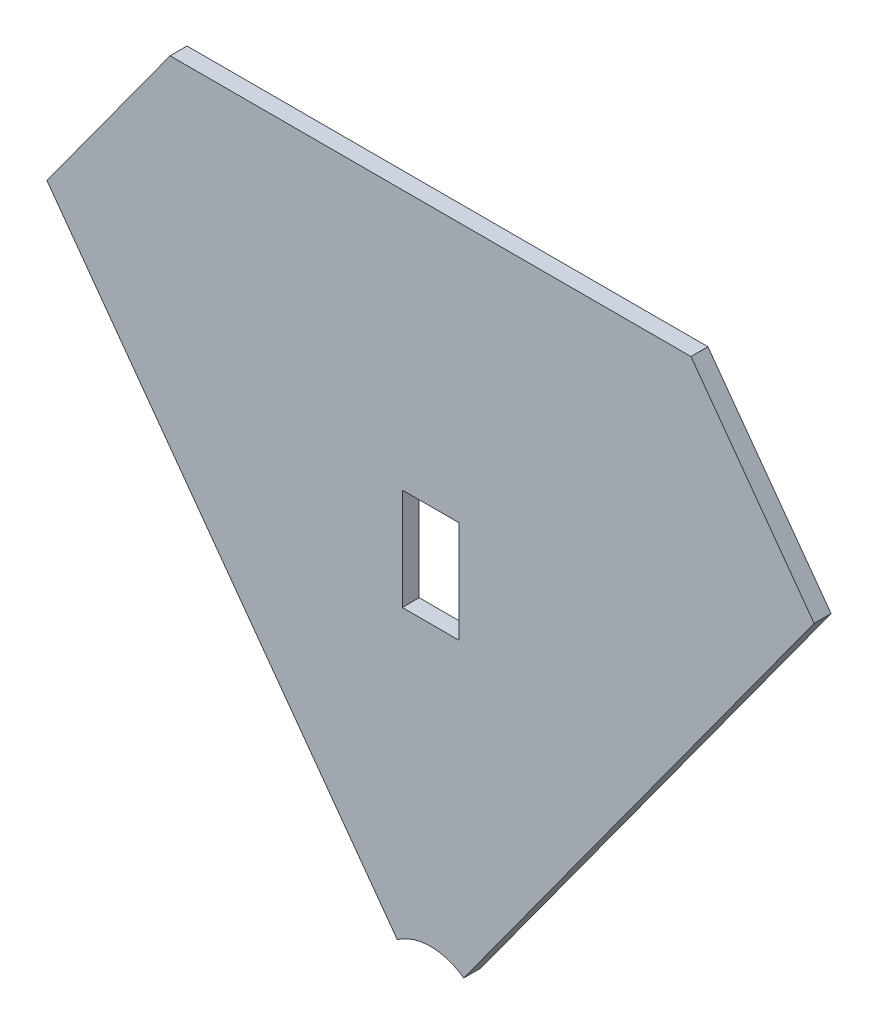
ISO-10303-21;
HEADER;
FILE_DESCRIPTION(('STEP AP214'),'2;1');
FILE_NAME('part.step','',(''),(''),'','','');
FILE_SCHEMA(('AUTOMOTIVE_DESIGN { 1 0 10303 214 1 1 1 1 }'));
ENDSEC;
DATA;
#1=APPLICATION_CONTEXT('core data for automotive mechanical design processes');
#2=APPLICATION_PROTOCOL_DEFINITION('international standard','automotive_design',2000,#1);
#3=PRODUCT_CONTEXT('',#1,'mechanical');
#4=PRODUCT('Part','Part','',(#3));
#5=PRODUCT_RELATED_PRODUCT_CATEGORY('part','',(#4));
#6=PRODUCT_DEFINITION_FORMATION('','',#4);
#7=PRODUCT_DEFINITION_CONTEXT('part definition',#1,'design');
#8=PRODUCT_DEFINITION('design','',#6,#7);
#9=PRODUCT_DEFINITION_SHAPE('','',#8);
#10=(LENGTH_UNIT() NAMED_UNIT(*) SI_UNIT(.MILLI.,.METRE.));
#11=(NAMED_UNIT(*) PLANE_ANGLE_UNIT() SI_UNIT($,.RADIAN.));
#12=(NAMED_UNIT(*) SI_UNIT($,.STERADIAN.) SOLID_ANGLE_UNIT());
#13=UNCERTAINTY_MEASURE_WITH_UNIT(LENGTH_MEASURE(1.E-05),#10,'distance_accuracy_value','');
#14=(GEOMETRIC_REPRESENTATION_CONTEXT(3) GLOBAL_UNCERTAINTY_ASSIGNED_CONTEXT((#13)) GLOBAL_UNIT_ASSIGNED_CONTEXT((#10,
#11,#12)) REPRESENTATION_CONTEXT('',''));
#15=CARTESIAN_POINT('',(0.,0.,0.));
#16=DIRECTION('',(0.,0.,1.));
#17=DIRECTION('',(1.,0.,0.));
#18=AXIS2_PLACEMENT_3D('',#15,#16,#17);
#19=CARTESIAN_POINT('',(0.,0.,3.));
#20=DIRECTION('',(0.,0.,1.));
#21=DIRECTION('',(1.,0.,0.));
#22=AXIS2_PLACEMENT_3D('',#19,#20,#21);
#23=PLANE('',#22);
#24=DIRECTION('',(1.,0.,0.));
#25=VECTOR('',#24,1.);
#26=CARTESIAN_POINT('',(-5.00000000000013,59.425,3.));
#27=LINE('',#26,#25);
#28=CARTESIAN_POINT('',(-5.00000000000013,59.425,3.));
#29=VERTEX_POINT('',#28);
#30=CARTESIAN_POINT('',(4.99999999999987,59.425,3.));
#31=VERTEX_POINT('',#30);
#32=EDGE_CURVE('E168',#29,#31,#27,.T.);
#33=ORIENTED_EDGE('',*,*,#32,.F.);
#34=DIRECTION('',(0.,-1.,0.));
#35=VECTOR('',#34,1.);
#36=CARTESIAN_POINT('',(-5.00000000000013,77.425,3.));
#37=LINE('',#36,#35);
#38=CARTESIAN_POINT('',(-5.00000000000013,77.425,3.));
#39=VERTEX_POINT('',#38);
#40=EDGE_CURVE('E153',#39,#29,#37,.T.);
#41=ORIENTED_EDGE('',*,*,#40,.F.);
#42=DIRECTION('',(-1.,0.,0.));
#43=VECTOR('',#42,1.);
#44=CARTESIAN_POINT('',(-5.00000000000013,77.425,3.));
#45=LINE('',#44,#43);
#46=CARTESIAN_POINT('',(4.99999999999987,77.425,3.));
#47=VERTEX_POINT('',#46);
#48=EDGE_CURVE('E148',#47,#39,#45,.T.);
#49=ORIENTED_EDGE('',*,*,#48,.F.);
#50=DIRECTION('',(0.,1.,0.));
#51=VECTOR('',#50,1.);
#52=CARTESIAN_POINT('',(4.99999999999987,77.425,3.));
#53=LINE('',#52,#51);
#54=EDGE_CURVE('E163',#31,#47,#53,.T.);
#55=ORIENTED_EDGE('',*,*,#54,.F.);
#56=EDGE_LOOP('',(#33,#41,#49,#55));
#57=FACE_BOUND('',#56,.T.);
#58=DIRECTION('',(0.587785252292471,-0.809016994374949,0.));
#59=VECTOR('',#58,1.);
#60=CARTESIAN_POINT('',(-56.9790977588202,78.425,3.));
#61=LINE('',#60,#59);
#62=CARTESIAN_POINT('',(-67.8772356789005,93.425,3.));
#63=VERTEX_POINT('',#62);
#64=CARTESIAN_POINT('',(-5.87785252292472,8.09016994374949,3.));
#65=VERTEX_POINT('',#64);
#66=EDGE_CURVE('E137',#63,#65,#61,.T.);
#67=ORIENTED_EDGE('',*,*,#66,.T.);
#68=CARTESIAN_POINT('',(0.,0.,3.));
#69=DIRECTION('',(0.,0.,-1.));
#70=DIRECTION('',(-1.,0.,0.));
#71=AXIS2_PLACEMENT_3D('',#68,#69,#70);
#72=CIRCLE('',#71,10.);
#73=CARTESIAN_POINT('',(5.87785252292471,8.09016994374949,3.));
#74=VERTEX_POINT('',#73);
#75=EDGE_CURVE('E120',#65,#74,#72,.T.);
#76=ORIENTED_EDGE('',*,*,#75,.T.);
#77=DIRECTION('',(0.587785252292471,0.809016994374949,0.));
#78=VECTOR('',#77,1.);
#79=CARTESIAN_POINT('',(0.,0.,3.));
#80=LINE('',#79,#78);
#81=CARTESIAN_POINT('',(67.8772356789005,93.425,3.));
#82=VERTEX_POINT('',#81);
#83=EDGE_CURVE('E50',#74,#82,#80,.T.);
#84=ORIENTED_EDGE('',*,*,#83,.T.);
#85=DIRECTION('',(0.587785252292472,-0.809016994374948,0.));
#86=VECTOR('',#85,1.);
#87=CARTESIAN_POINT('',(46.0809598387398,123.425,3.));
#88=LINE('',#87,#86);
#89=CARTESIAN_POINT('',(46.0809598387398,123.425,3.));
#90=VERTEX_POINT('',#89);
#91=EDGE_CURVE('E178',#90,#82,#88,.T.);
#92=ORIENTED_EDGE('',*,*,#91,.F.);
#93=DIRECTION('',(1.,0.,0.));
#94=VECTOR('',#93,1.);
#95=CARTESIAN_POINT('',(89.6735115190613,123.425,3.));
#96=LINE('',#95,#94);
#97=CARTESIAN_POINT('',(-46.0809598387398,123.425,3.));
#98=VERTEX_POINT('',#97);
#99=EDGE_CURVE('E164',#98,#90,#96,.T.);
#100=ORIENTED_EDGE('',*,*,#99,.F.);
#101=DIRECTION('',(0.587785252292471,0.809016994374949,0.));
#102=VECTOR('',#101,1.);
#103=CARTESIAN_POINT('',(-46.0809598387398,123.425,3.));
#104=LINE('',#103,#102);
#105=EDGE_CURVE('E182',#63,#98,#104,.T.);
#106=ORIENTED_EDGE('',*,*,#105,.F.);
#107=EDGE_LOOP('',(#67,#76,#84,#92,#100,#106));
#108=FACE_BOUND('',#107,.T.);
#109=ADVANCED_FACE('F39',(#57,#108),#23,.T.);
#110=CARTESIAN_POINT('',(0.,0.,0.));
#111=DIRECTION('',(0.,0.,1.));
#112=DIRECTION('',(1.,0.,0.));
#113=AXIS2_PLACEMENT_3D('',#110,#111,#112);
#114=PLANE('',#113);
#115=DIRECTION('',(0.,-1.,0.));
#116=VECTOR('',#115,1.);
#117=CARTESIAN_POINT('',(-5.00000000000013,77.425,0.));
#118=LINE('',#117,#116);
#119=CARTESIAN_POINT('',(-5.00000000000013,77.425,0.));
#120=VERTEX_POINT('',#119);
#121=CARTESIAN_POINT('',(-5.00000000000013,59.425,0.));
#122=VERTEX_POINT('',#121);
#123=EDGE_CURVE('E158',#120,#122,#118,.T.);
#124=ORIENTED_EDGE('',*,*,#123,.T.);
#125=DIRECTION('',(1.,0.,0.));
#126=VECTOR('',#125,1.);
#127=CARTESIAN_POINT('',(-5.00000000000013,59.425,0.));
#128=LINE('',#127,#126);
#129=CARTESIAN_POINT('',(4.99999999999987,59.425,0.));
#130=VERTEX_POINT('',#129);
#131=EDGE_CURVE('E160',#122,#130,#128,.T.);
#132=ORIENTED_EDGE('',*,*,#131,.T.);
#133=DIRECTION('',(0.,1.,0.));
#134=VECTOR('',#133,1.);
#135=CARTESIAN_POINT('',(4.99999999999987,77.425,0.));
#136=LINE('',#135,#134);
#137=CARTESIAN_POINT('',(4.99999999999987,77.425,0.));
#138=VERTEX_POINT('',#137);
#139=EDGE_CURVE('E154',#130,#138,#136,.T.);
#140=ORIENTED_EDGE('',*,*,#139,.T.);
#141=DIRECTION('',(-1.,0.,0.));
#142=VECTOR('',#141,1.);
#143=CARTESIAN_POINT('',(-5.00000000000013,77.425,0.));
#144=LINE('',#143,#142);
#145=EDGE_CURVE('E150',#138,#120,#144,.T.);
#146=ORIENTED_EDGE('',*,*,#145,.T.);
#147=EDGE_LOOP('',(#124,#132,#140,#146));
#148=FACE_BOUND('',#147,.T.);
#149=CARTESIAN_POINT('',(0.,0.,0.));
#150=DIRECTION('',(0.,0.,-1.));
#151=DIRECTION('',(-1.,0.,0.));
#152=AXIS2_PLACEMENT_3D('',#149,#150,#151);
#153=CIRCLE('',#152,10.);
#154=CARTESIAN_POINT('',(-5.87785252292472,8.09016994374949,0.));
#155=VERTEX_POINT('',#154);
#156=CARTESIAN_POINT('',(5.87785252292471,8.09016994374949,0.));
#157=VERTEX_POINT('',#156);
#158=EDGE_CURVE('E53',#155,#157,#153,.T.);
#159=ORIENTED_EDGE('',*,*,#158,.F.);
#160=DIRECTION('',(0.587785252292471,-0.809016994374949,0.));
#161=VECTOR('',#160,1.);
#162=CARTESIAN_POINT('',(-56.9790977588202,78.425,0.));
#163=LINE('',#162,#161);
#164=CARTESIAN_POINT('',(-67.8772356789005,93.425,0.));
#165=VERTEX_POINT('',#164);
#166=EDGE_CURVE('E128',#165,#155,#163,.T.);
#167=ORIENTED_EDGE('',*,*,#166,.F.);
#168=DIRECTION('',(0.587785252292471,0.809016994374949,0.));
#169=VECTOR('',#168,1.);
#170=CARTESIAN_POINT('',(-46.0809598387398,123.425,0.));
#171=LINE('',#170,#169);
#172=CARTESIAN_POINT('',(-46.0809598387398,123.425,0.));
#173=VERTEX_POINT('',#172);
#174=EDGE_CURVE('E190',#165,#173,#171,.T.);
#175=ORIENTED_EDGE('',*,*,#174,.T.);
#176=DIRECTION('',(1.,0.,0.));
#177=VECTOR('',#176,1.);
#178=CARTESIAN_POINT('',(89.6735115190613,123.425,0.));
#179=LINE('',#178,#177);
#180=CARTESIAN_POINT('',(46.0809598387398,123.425,0.));
#181=VERTEX_POINT('',#180);
#182=EDGE_CURVE('E174',#173,#181,#179,.T.);
#183=ORIENTED_EDGE('',*,*,#182,.T.);
#184=DIRECTION('',(0.587785252292472,-0.809016994374948,0.));
#185=VECTOR('',#184,1.);
#186=CARTESIAN_POINT('',(46.0809598387398,123.425,0.));
#187=LINE('',#186,#185);
#188=CARTESIAN_POINT('',(67.8772356789005,93.425,0.));
#189=VERTEX_POINT('',#188);
#190=EDGE_CURVE('E62',#181,#189,#187,.T.);
#191=ORIENTED_EDGE('',*,*,#190,.T.);
#192=DIRECTION('',(0.587785252292471,0.809016994374949,0.));
#193=VECTOR('',#192,1.);
#194=CARTESIAN_POINT('',(0.,0.,0.));
#195=LINE('',#194,#193);
#196=EDGE_CURVE('E129',#157,#189,#195,.T.);
#197=ORIENTED_EDGE('',*,*,#196,.F.);
#198=EDGE_LOOP('',(#159,#167,#175,#183,#191,#197));
#199=FACE_BOUND('',#198,.T.);
#200=ADVANCED_FACE('F130',(#148,#199),#114,.F.);
#201=CARTESIAN_POINT('',(-56.9790977588202,78.425,3.));
#202=DIRECTION('',(0.809016994374949,0.587785252292471,0.));
#203=DIRECTION('',(-0.587785252292471,0.809016994374949,0.));
#204=AXIS2_PLACEMENT_3D('',#201,#202,#203);
#205=PLANE('',#204);
#206=ORIENTED_EDGE('',*,*,#166,.T.);
#207=DIRECTION('',(0.,0.,-1.));
#208=VECTOR('',#207,1.);
#209=CARTESIAN_POINT('',(-5.87785252292472,8.09016994374949,3.));
#210=LINE('',#209,#208);
#211=EDGE_CURVE('E114',#155,#65,#210,.F.);
#212=ORIENTED_EDGE('',*,*,#211,.T.);
#213=ORIENTED_EDGE('',*,*,#66,.F.);
#214=DIRECTION('',(0.,0.,1.));
#215=VECTOR('',#214,1.);
#216=CARTESIAN_POINT('',(-67.8772356789005,93.425,0.));
#217=LINE('',#216,#215);
#218=EDGE_CURVE('E134',#165,#63,#217,.T.);
#219=ORIENTED_EDGE('',*,*,#218,.F.);
#220=EDGE_LOOP('',(#206,#212,#213,#219));
#221=FACE_BOUND('',#220,.T.);
#222=ADVANCED_FACE('F41',(#221),#205,.F.);
#223=CARTESIAN_POINT('',(89.6735115190613,123.425,187.9063402716));
#224=DIRECTION('',(0.,1.,0.));
#225=DIRECTION('',(0.,0.,1.));
#226=AXIS2_PLACEMENT_3D('',#223,#224,#225);
#227=PLANE('',#226);
#228=ORIENTED_EDGE('',*,*,#182,.F.);
#229=DIRECTION('',(0.,0.,1.));
#230=VECTOR('',#229,1.);
#231=CARTESIAN_POINT('',(-46.0809598387398,123.425,0.));
#232=LINE('',#231,#230);
#233=EDGE_CURVE('E177',#173,#98,#232,.T.);
#234=ORIENTED_EDGE('',*,*,#233,.T.);
#235=ORIENTED_EDGE('',*,*,#99,.T.);
#236=DIRECTION('',(0.,0.,1.));
#237=VECTOR('',#236,1.);
#238=CARTESIAN_POINT('',(46.0809598387398,123.425,0.));
#239=LINE('',#238,#237);
#240=EDGE_CURVE('E179',#181,#90,#239,.T.);
#241=ORIENTED_EDGE('',*,*,#240,.F.);
#242=EDGE_LOOP('',(#228,#234,#235,#241));
#243=FACE_BOUND('',#242,.T.);
#244=ADVANCED_FACE('F201',(#243),#227,.T.);
#245=CARTESIAN_POINT('',(0.,0.,3.));
#246=DIRECTION('',(-0.809016994374949,0.587785252292471,0.));
#247=DIRECTION('',(-0.587785252292471,-0.809016994374949,0.));
#248=AXIS2_PLACEMENT_3D('',#245,#246,#247);
#249=PLANE('',#248);
#250=ORIENTED_EDGE('',*,*,#83,.F.);
#251=DIRECTION('',(0.,0.,-1.));
#252=VECTOR('',#251,1.);
#253=CARTESIAN_POINT('',(5.87785252292471,8.09016994374949,3.));
#254=LINE('',#253,#252);
#255=EDGE_CURVE('E11',#74,#157,#254,.T.);
#256=ORIENTED_EDGE('',*,*,#255,.T.);
#257=ORIENTED_EDGE('',*,*,#196,.T.);
#258=DIRECTION('',(0.,0.,1.));
#259=VECTOR('',#258,1.);
#260=CARTESIAN_POINT('',(67.8772356789005,93.425,0.));
#261=LINE('',#260,#259);
#262=EDGE_CURVE('E125',#189,#82,#261,.T.);
#263=ORIENTED_EDGE('',*,*,#262,.T.);
#264=EDGE_LOOP('',(#250,#256,#257,#263));
#265=FACE_BOUND('',#264,.T.);
#266=ADVANCED_FACE('F200',(#265),#249,.F.);
#267=CARTESIAN_POINT('',(-5.00000000000013,77.425,3.));
#268=DIRECTION('',(1.,0.,0.));
#269=DIRECTION('',(0.,0.,-1.));
#270=AXIS2_PLACEMENT_3D('',#267,#268,#269);
#271=PLANE('',#270);
#272=ORIENTED_EDGE('',*,*,#123,.F.);
#273=DIRECTION('',(0.,0.,-1.));
#274=VECTOR('',#273,1.);
#275=CARTESIAN_POINT('',(-5.00000000000013,77.425,3.));
#276=LINE('',#275,#274);
#277=EDGE_CURVE('E146',#39,#120,#276,.T.);
#278=ORIENTED_EDGE('',*,*,#277,.F.);
#279=ORIENTED_EDGE('',*,*,#40,.T.);
#280=DIRECTION('',(0.,0.,-1.));
#281=VECTOR('',#280,1.);
#282=CARTESIAN_POINT('',(-5.00000000000013,59.425,3.));
#283=LINE('',#282,#281);
#284=EDGE_CURVE('E131',#29,#122,#283,.T.);
#285=ORIENTED_EDGE('',*,*,#284,.T.);
#286=EDGE_LOOP('',(#272,#278,#279,#285));
#287=FACE_BOUND('',#286,.T.);
#288=ADVANCED_FACE('F223',(#287),#271,.T.);
#289=CARTESIAN_POINT('',(-5.00000000000013,59.425,3.));
#290=DIRECTION('',(0.,1.,0.));
#291=DIRECTION('',(0.,0.,1.));
#292=AXIS2_PLACEMENT_3D('',#289,#290,#291);
#293=PLANE('',#292);
#294=ORIENTED_EDGE('',*,*,#131,.F.);
#295=ORIENTED_EDGE('',*,*,#284,.F.);
#296=ORIENTED_EDGE('',*,*,#32,.T.);
#297=DIRECTION('',(0.,0.,-1.));
#298=VECTOR('',#297,1.);
#299=CARTESIAN_POINT('',(4.99999999999987,59.425,3.));
#300=LINE('',#299,#298);
#301=EDGE_CURVE('E139',#31,#130,#300,.T.);
#302=ORIENTED_EDGE('',*,*,#301,.T.);
#303=EDGE_LOOP('',(#294,#295,#296,#302));
#304=FACE_BOUND('',#303,.T.);
#305=ADVANCED_FACE('F232',(#304),#293,.T.);
#306=CARTESIAN_POINT('',(4.99999999999987,77.425,3.));
#307=DIRECTION('',(-1.,0.,0.));
#308=DIRECTION('',(0.,0.,1.));
#309=AXIS2_PLACEMENT_3D('',#306,#307,#308);
#310=PLANE('',#309);
#311=ORIENTED_EDGE('',*,*,#139,.F.);
#312=ORIENTED_EDGE('',*,*,#301,.F.);
#313=ORIENTED_EDGE('',*,*,#54,.T.);
#314=DIRECTION('',(0.,0.,-1.));
#315=VECTOR('',#314,1.);
#316=CARTESIAN_POINT('',(4.99999999999987,77.425,3.));
#317=LINE('',#316,#315);
#318=EDGE_CURVE('E144',#47,#138,#317,.T.);
#319=ORIENTED_EDGE('',*,*,#318,.T.);
#320=EDGE_LOOP('',(#311,#312,#313,#319));
#321=FACE_BOUND('',#320,.T.);
#322=ADVANCED_FACE('F238',(#321),#310,.T.);
#323=CARTESIAN_POINT('',(-5.00000000000013,77.425,3.));
#324=DIRECTION('',(0.,-1.,0.));
#325=DIRECTION('',(0.,0.,-1.));
#326=AXIS2_PLACEMENT_3D('',#323,#324,#325);
#327=PLANE('',#326);
#328=ORIENTED_EDGE('',*,*,#145,.F.);
#329=ORIENTED_EDGE('',*,*,#318,.F.);
#330=ORIENTED_EDGE('',*,*,#48,.T.);
#331=ORIENTED_EDGE('',*,*,#277,.T.);
#332=EDGE_LOOP('',(#328,#329,#330,#331));
#333=FACE_BOUND('',#332,.T.);
#334=ADVANCED_FACE('F214',(#333),#327,.T.);
#335=CARTESIAN_POINT('',(46.0809598387398,123.425,0.));
#336=DIRECTION('',(-0.809016994374948,-0.587785252292472,0.));
#337=DIRECTION('',(0.587785252292472,-0.809016994374949,0.));
#338=AXIS2_PLACEMENT_3D('',#335,#336,#337);
#339=PLANE('',#338);
#340=ORIENTED_EDGE('',*,*,#91,.T.);
#341=ORIENTED_EDGE('',*,*,#262,.F.);
#342=ORIENTED_EDGE('',*,*,#190,.F.);
#343=ORIENTED_EDGE('',*,*,#240,.T.);
#344=EDGE_LOOP('',(#340,#341,#342,#343));
#345=FACE_BOUND('',#344,.T.);
#346=ADVANCED_FACE('F198',(#345),#339,.F.);
#347=CARTESIAN_POINT('',(-46.0809598387398,123.425,0.));
#348=DIRECTION('',(0.809016994374949,-0.587785252292471,0.));
#349=DIRECTION('',(0.587785252292471,0.809016994374949,0.));
#350=AXIS2_PLACEMENT_3D('',#347,#348,#349);
#351=PLANE('',#350);
#352=ORIENTED_EDGE('',*,*,#105,.T.);
#353=ORIENTED_EDGE('',*,*,#233,.F.);
#354=ORIENTED_EDGE('',*,*,#174,.F.);
#355=ORIENTED_EDGE('',*,*,#218,.T.);
#356=EDGE_LOOP('',(#352,#353,#354,#355));
#357=FACE_BOUND('',#356,.T.);
#358=ADVANCED_FACE('F203',(#357),#351,.F.);
#359=CARTESIAN_POINT('',(0.,0.,3.));
#360=DIRECTION('',(0.,0.,-1.));
#361=DIRECTION('',(-1.,0.,0.));
#362=AXIS2_PLACEMENT_3D('',#359,#360,#361);
#363=CYLINDRICAL_SURFACE('',#362,10.);
#364=ORIENTED_EDGE('',*,*,#158,.T.);
#365=ORIENTED_EDGE('',*,*,#255,.F.);
#366=ORIENTED_EDGE('',*,*,#75,.F.);
#367=ORIENTED_EDGE('',*,*,#211,.F.);
#368=EDGE_LOOP('',(#364,#365,#366,#367));
#369=FACE_BOUND('',#368,.T.);
#370=ADVANCED_FACE('F112',(#369),#363,.F.);
#371=CLOSED_SHELL('',(#109,#200,#222,#244,#266,#288,#305,#322,#334,#346,#358,#370));
#372=MANIFOLD_SOLID_BREP('B2',#371);
#373=ADVANCED_BREP_SHAPE_REPRESENTATION('',(#18,#372),#14);
#374=SHAPE_DEFINITION_REPRESENTATION(#9,#373);
ENDSEC;
END-ISO-10303-21;
